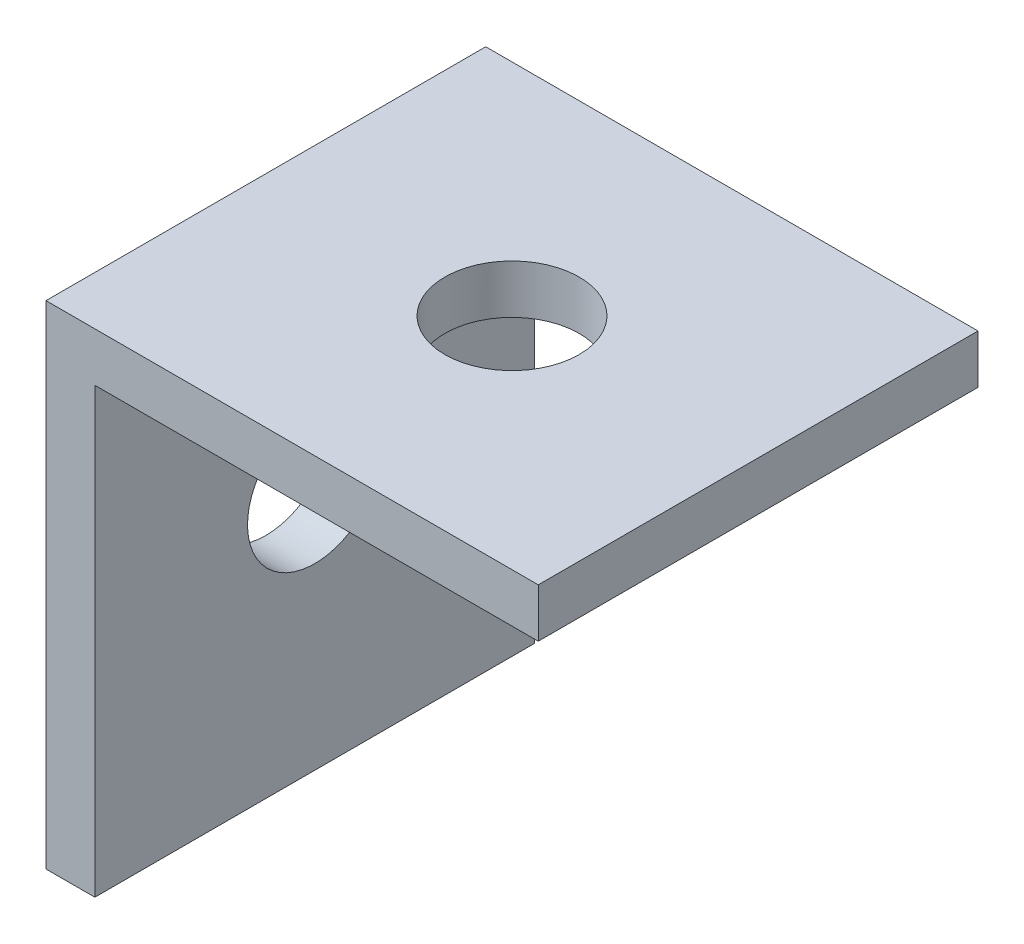
ISO-10303-21;
HEADER;
FILE_DESCRIPTION(('STEP AP214'),'2;1');
FILE_NAME('part.step','',(''),(''),'','','');
FILE_SCHEMA(('AUTOMOTIVE_DESIGN { 1 0 10303 214 1 1 1 1 }'));
ENDSEC;
DATA;
#1=APPLICATION_CONTEXT('core data for automotive mechanical design processes');
#2=APPLICATION_PROTOCOL_DEFINITION('international standard','automotive_design',2000,#1);
#3=PRODUCT_CONTEXT('',#1,'mechanical');
#4=PRODUCT('Part','Part','',(#3));
#5=PRODUCT_RELATED_PRODUCT_CATEGORY('part','',(#4));
#6=PRODUCT_DEFINITION_FORMATION('','',#4);
#7=PRODUCT_DEFINITION_CONTEXT('part definition',#1,'design');
#8=PRODUCT_DEFINITION('design','',#6,#7);
#9=PRODUCT_DEFINITION_SHAPE('','',#8);
#10=(LENGTH_UNIT() NAMED_UNIT(*) SI_UNIT(.MILLI.,.METRE.));
#11=(NAMED_UNIT(*) PLANE_ANGLE_UNIT() SI_UNIT($,.RADIAN.));
#12=(NAMED_UNIT(*) SI_UNIT($,.STERADIAN.) SOLID_ANGLE_UNIT());
#13=UNCERTAINTY_MEASURE_WITH_UNIT(LENGTH_MEASURE(1.E-05),#10,'distance_accuracy_value','');
#14=(GEOMETRIC_REPRESENTATION_CONTEXT(3) GLOBAL_UNCERTAINTY_ASSIGNED_CONTEXT((#13)) GLOBAL_UNIT_ASSIGNED_CONTEXT((#10,
#11,#12)) REPRESENTATION_CONTEXT('',''));
#15=CARTESIAN_POINT('',(0.,0.,0.));
#16=DIRECTION('',(0.,0.,1.));
#17=DIRECTION('',(1.,0.,0.));
#18=AXIS2_PLACEMENT_3D('',#15,#16,#17);
#19=CARTESIAN_POINT('',(0.,0.,-18.));
#20=DIRECTION('',(0.,1.,0.));
#21=DIRECTION('',(0.,0.,1.));
#22=AXIS2_PLACEMENT_3D('',#19,#20,#21);
#23=PLANE('',#22);
#24=CARTESIAN_POINT('',(10.075,0.,-9.));
#25=DIRECTION('',(0.,1.,0.));
#26=DIRECTION('',(0.,0.,1.));
#27=AXIS2_PLACEMENT_3D('',#24,#25,#26);
#28=CIRCLE('',#27,2.75);
#29=CARTESIAN_POINT('',(10.075,0.,-6.25));
#30=VERTEX_POINT('',#29);
#31=EDGE_CURVE('E122',#30,#30,#28,.T.);
#32=ORIENTED_EDGE('',*,*,#31,.F.);
#33=EDGE_LOOP('',(#32));
#34=FACE_BOUND('',#33,.T.);
#35=DIRECTION('',(-1.,0.,0.));
#36=VECTOR('',#35,1.);
#37=CARTESIAN_POINT('',(0.,0.,0.));
#38=LINE('',#37,#36);
#39=CARTESIAN_POINT('',(20.15,0.,0.));
#40=VERTEX_POINT('',#39);
#41=CARTESIAN_POINT('',(0.,0.,0.));
#42=VERTEX_POINT('',#41);
#43=EDGE_CURVE('E118',#40,#42,#38,.T.);
#44=ORIENTED_EDGE('',*,*,#43,.F.);
#45=DIRECTION('',(0.,0.,1.));
#46=VECTOR('',#45,1.);
#47=CARTESIAN_POINT('',(20.15,0.,-18.));
#48=LINE('',#47,#46);
#49=CARTESIAN_POINT('',(20.15,0.,-18.));
#50=VERTEX_POINT('',#49);
#51=EDGE_CURVE('E11',#50,#40,#48,.T.);
#52=ORIENTED_EDGE('',*,*,#51,.F.);
#53=DIRECTION('',(-1.,0.,0.));
#54=VECTOR('',#53,1.);
#55=CARTESIAN_POINT('',(0.,0.,-18.));
#56=LINE('',#55,#54);
#57=CARTESIAN_POINT('',(0.,0.,-18.));
#58=VERTEX_POINT('',#57);
#59=EDGE_CURVE('E133',#50,#58,#56,.T.);
#60=ORIENTED_EDGE('',*,*,#59,.T.);
#61=DIRECTION('',(0.,0.,1.));
#62=VECTOR('',#61,1.);
#63=CARTESIAN_POINT('',(0.,0.,-18.));
#64=LINE('',#63,#62);
#65=EDGE_CURVE('E82',#58,#42,#64,.T.);
#66=ORIENTED_EDGE('',*,*,#65,.T.);
#67=EDGE_LOOP('',(#44,#52,#60,#66));
#68=FACE_BOUND('',#67,.T.);
#69=ADVANCED_FACE('F32',(#34,#68),#23,.T.);
#70=CARTESIAN_POINT('',(20.15,-2.00000000000002,-18.));
#71=DIRECTION('',(1.,0.,0.));
#72=DIRECTION('',(0.,1.,0.));
#73=AXIS2_PLACEMENT_3D('',#70,#71,#72);
#74=PLANE('',#73);
#75=DIRECTION('',(0.,1.,0.));
#76=VECTOR('',#75,1.);
#77=CARTESIAN_POINT('',(20.15,-2.00000000000002,0.));
#78=LINE('',#77,#76);
#79=CARTESIAN_POINT('',(20.15,-2.00000000000002,0.));
#80=VERTEX_POINT('',#79);
#81=EDGE_CURVE('E131',#80,#40,#78,.T.);
#82=ORIENTED_EDGE('',*,*,#81,.F.);
#83=DIRECTION('',(0.,0.,1.));
#84=VECTOR('',#83,1.);
#85=CARTESIAN_POINT('',(20.15,-2.00000000000002,-18.));
#86=LINE('',#85,#84);
#87=CARTESIAN_POINT('',(20.15,-2.00000000000002,-18.));
#88=VERTEX_POINT('',#87);
#89=EDGE_CURVE('E41',#88,#80,#86,.T.);
#90=ORIENTED_EDGE('',*,*,#89,.F.);
#91=DIRECTION('',(0.,1.,0.));
#92=VECTOR('',#91,1.);
#93=CARTESIAN_POINT('',(20.15,-2.00000000000002,-18.));
#94=LINE('',#93,#92);
#95=EDGE_CURVE('E108',#88,#50,#94,.T.);
#96=ORIENTED_EDGE('',*,*,#95,.T.);
#97=ORIENTED_EDGE('',*,*,#51,.T.);
#98=EDGE_LOOP('',(#82,#90,#96,#97));
#99=FACE_BOUND('',#98,.T.);
#100=ADVANCED_FACE('F142',(#99),#74,.T.);
#101=CARTESIAN_POINT('',(2.,-2.00000000000002,-18.));
#102=DIRECTION('',(0.,-1.,0.));
#103=DIRECTION('',(1.,0.,0.));
#104=AXIS2_PLACEMENT_3D('',#101,#102,#103);
#105=PLANE('',#104);
#106=CARTESIAN_POINT('',(10.075,-2.00000000000002,-9.));
#107=DIRECTION('',(0.,-1.,0.));
#108=DIRECTION('',(1.,0.,0.));
#109=AXIS2_PLACEMENT_3D('',#106,#107,#108);
#110=CIRCLE('',#109,2.75);
#111=CARTESIAN_POINT('',(12.825,-2.00000000000002,-9.));
#112=VERTEX_POINT('',#111);
#113=EDGE_CURVE('E169',#112,#112,#110,.T.);
#114=ORIENTED_EDGE('',*,*,#113,.F.);
#115=EDGE_LOOP('',(#114));
#116=FACE_BOUND('',#115,.T.);
#117=DIRECTION('',(1.,0.,0.));
#118=VECTOR('',#117,1.);
#119=CARTESIAN_POINT('',(2.,-2.00000000000002,0.));
#120=LINE('',#119,#118);
#121=CARTESIAN_POINT('',(2.,-2.00000000000002,0.));
#122=VERTEX_POINT('',#121);
#123=EDGE_CURVE('E95',#122,#80,#120,.T.);
#124=ORIENTED_EDGE('',*,*,#123,.F.);
#125=DIRECTION('',(0.,0.,1.));
#126=VECTOR('',#125,1.);
#127=CARTESIAN_POINT('',(2.,-2.00000000000002,-18.));
#128=LINE('',#127,#126);
#129=CARTESIAN_POINT('',(2.,-2.00000000000002,-18.));
#130=VERTEX_POINT('',#129);
#131=EDGE_CURVE('E90',#130,#122,#128,.T.);
#132=ORIENTED_EDGE('',*,*,#131,.F.);
#133=DIRECTION('',(1.,0.,0.));
#134=VECTOR('',#133,1.);
#135=CARTESIAN_POINT('',(2.,-2.00000000000002,-18.));
#136=LINE('',#135,#134);
#137=EDGE_CURVE('E93',#130,#88,#136,.T.);
#138=ORIENTED_EDGE('',*,*,#137,.T.);
#139=ORIENTED_EDGE('',*,*,#89,.T.);
#140=EDGE_LOOP('',(#124,#132,#138,#139));
#141=FACE_BOUND('',#140,.T.);
#142=ADVANCED_FACE('F92',(#116,#141),#105,.T.);
#143=CARTESIAN_POINT('',(2.,-2.00000000000002,-18.));
#144=DIRECTION('',(1.,0.,0.));
#145=DIRECTION('',(0.,1.,0.));
#146=AXIS2_PLACEMENT_3D('',#143,#144,#145);
#147=PLANE('',#146);
#148=CARTESIAN_POINT('',(2.,-10.075,-9.));
#149=DIRECTION('',(1.,0.,0.));
#150=DIRECTION('',(0.,1.,0.));
#151=AXIS2_PLACEMENT_3D('',#148,#149,#150);
#152=CIRCLE('',#151,2.75);
#153=CARTESIAN_POINT('',(2.,-7.325,-9.));
#154=VERTEX_POINT('',#153);
#155=EDGE_CURVE('E170',#154,#154,#152,.T.);
#156=ORIENTED_EDGE('',*,*,#155,.F.);
#157=EDGE_LOOP('',(#156));
#158=FACE_BOUND('',#157,.T.);
#159=DIRECTION('',(0.,1.,0.));
#160=VECTOR('',#159,1.);
#161=CARTESIAN_POINT('',(2.,-2.00000000000002,0.));
#162=LINE('',#161,#160);
#163=CARTESIAN_POINT('',(2.,-20.15,0.));
#164=VERTEX_POINT('',#163);
#165=EDGE_CURVE('E128',#164,#122,#162,.T.);
#166=ORIENTED_EDGE('',*,*,#165,.F.);
#167=DIRECTION('',(0.,0.,1.));
#168=VECTOR('',#167,1.);
#169=CARTESIAN_POINT('',(2.,-20.15,-18.));
#170=LINE('',#169,#168);
#171=CARTESIAN_POINT('',(2.,-20.15,-18.));
#172=VERTEX_POINT('',#171);
#173=EDGE_CURVE('E100',#172,#164,#170,.T.);
#174=ORIENTED_EDGE('',*,*,#173,.F.);
#175=DIRECTION('',(0.,1.,0.));
#176=VECTOR('',#175,1.);
#177=CARTESIAN_POINT('',(2.,-2.00000000000002,-18.));
#178=LINE('',#177,#176);
#179=EDGE_CURVE('E106',#172,#130,#178,.T.);
#180=ORIENTED_EDGE('',*,*,#179,.T.);
#181=ORIENTED_EDGE('',*,*,#131,.T.);
#182=EDGE_LOOP('',(#166,#174,#180,#181));
#183=FACE_BOUND('',#182,.T.);
#184=ADVANCED_FACE('F110',(#158,#183),#147,.T.);
#185=CARTESIAN_POINT('',(2.,-20.15,-18.));
#186=DIRECTION('',(0.,-1.,0.));
#187=DIRECTION('',(0.,0.,-1.));
#188=AXIS2_PLACEMENT_3D('',#185,#186,#187);
#189=PLANE('',#188);
#190=DIRECTION('',(1.,0.,0.));
#191=VECTOR('',#190,1.);
#192=CARTESIAN_POINT('',(2.,-20.15,0.));
#193=LINE('',#192,#191);
#194=CARTESIAN_POINT('',(0.,-20.15,0.));
#195=VERTEX_POINT('',#194);
#196=EDGE_CURVE('E125',#195,#164,#193,.T.);
#197=ORIENTED_EDGE('',*,*,#196,.F.);
#198=DIRECTION('',(0.,0.,1.));
#199=VECTOR('',#198,1.);
#200=CARTESIAN_POINT('',(0.,-20.15,-18.));
#201=LINE('',#200,#199);
#202=CARTESIAN_POINT('',(0.,-20.15,-18.));
#203=VERTEX_POINT('',#202);
#204=EDGE_CURVE('E137',#203,#195,#201,.T.);
#205=ORIENTED_EDGE('',*,*,#204,.F.);
#206=DIRECTION('',(1.,0.,0.));
#207=VECTOR('',#206,1.);
#208=CARTESIAN_POINT('',(2.,-20.15,-18.));
#209=LINE('',#208,#207);
#210=EDGE_CURVE('E111',#203,#172,#209,.T.);
#211=ORIENTED_EDGE('',*,*,#210,.T.);
#212=ORIENTED_EDGE('',*,*,#173,.T.);
#213=EDGE_LOOP('',(#197,#205,#211,#212));
#214=FACE_BOUND('',#213,.T.);
#215=ADVANCED_FACE('F157',(#214),#189,.T.);
#216=CARTESIAN_POINT('',(0.,0.,-18.));
#217=DIRECTION('',(-1.,0.,0.));
#218=DIRECTION('',(0.,-1.,0.));
#219=AXIS2_PLACEMENT_3D('',#216,#217,#218);
#220=PLANE('',#219);
#221=CARTESIAN_POINT('',(0.,-10.075,-9.));
#222=DIRECTION('',(-1.,0.,0.));
#223=DIRECTION('',(0.,-1.,0.));
#224=AXIS2_PLACEMENT_3D('',#221,#222,#223);
#225=CIRCLE('',#224,2.75);
#226=CARTESIAN_POINT('',(0.,-12.825,-9.));
#227=VERTEX_POINT('',#226);
#228=EDGE_CURVE('E35',#227,#227,#225,.T.);
#229=ORIENTED_EDGE('',*,*,#228,.F.);
#230=EDGE_LOOP('',(#229));
#231=FACE_BOUND('',#230,.T.);
#232=DIRECTION('',(0.,-1.,0.));
#233=VECTOR('',#232,1.);
#234=CARTESIAN_POINT('',(0.,0.,0.));
#235=LINE('',#234,#233);
#236=EDGE_CURVE('E121',#42,#195,#235,.T.);
#237=ORIENTED_EDGE('',*,*,#236,.F.);
#238=ORIENTED_EDGE('',*,*,#65,.F.);
#239=DIRECTION('',(0.,-1.,0.));
#240=VECTOR('',#239,1.);
#241=CARTESIAN_POINT('',(0.,0.,-18.));
#242=LINE('',#241,#240);
#243=EDGE_CURVE('E113',#58,#203,#242,.T.);
#244=ORIENTED_EDGE('',*,*,#243,.T.);
#245=ORIENTED_EDGE('',*,*,#204,.T.);
#246=EDGE_LOOP('',(#237,#238,#244,#245));
#247=FACE_BOUND('',#246,.T.);
#248=ADVANCED_FACE('F138',(#231,#247),#220,.T.);
#249=CARTESIAN_POINT('',(0.,0.,-18.));
#250=DIRECTION('',(0.,0.,1.));
#251=DIRECTION('',(1.,0.,0.));
#252=AXIS2_PLACEMENT_3D('',#249,#250,#251);
#253=PLANE('',#252);
#254=ORIENTED_EDGE('',*,*,#59,.F.);
#255=ORIENTED_EDGE('',*,*,#95,.F.);
#256=ORIENTED_EDGE('',*,*,#137,.F.);
#257=ORIENTED_EDGE('',*,*,#179,.F.);
#258=ORIENTED_EDGE('',*,*,#210,.F.);
#259=ORIENTED_EDGE('',*,*,#243,.F.);
#260=EDGE_LOOP('',(#254,#255,#256,#257,#258,#259));
#261=FACE_BOUND('',#260,.T.);
#262=ADVANCED_FACE('F104',(#261),#253,.F.);
#263=CARTESIAN_POINT('',(0.,0.,0.));
#264=DIRECTION('',(0.,0.,1.));
#265=DIRECTION('',(1.,0.,0.));
#266=AXIS2_PLACEMENT_3D('',#263,#264,#265);
#267=PLANE('',#266);
#268=ORIENTED_EDGE('',*,*,#43,.T.);
#269=ORIENTED_EDGE('',*,*,#236,.T.);
#270=ORIENTED_EDGE('',*,*,#196,.T.);
#271=ORIENTED_EDGE('',*,*,#165,.T.);
#272=ORIENTED_EDGE('',*,*,#123,.T.);
#273=ORIENTED_EDGE('',*,*,#81,.T.);
#274=EDGE_LOOP('',(#268,#269,#270,#271,#272,#273));
#275=FACE_BOUND('',#274,.T.);
#276=ADVANCED_FACE('F141',(#275),#267,.T.);
#277=CARTESIAN_POINT('',(10.075,16.,-9.));
#278=DIRECTION('',(0.,-1.,0.));
#279=DIRECTION('',(1.,0.,0.));
#280=AXIS2_PLACEMENT_3D('',#277,#278,#279);
#281=CYLINDRICAL_SURFACE('',#280,2.75);
#282=ORIENTED_EDGE('',*,*,#31,.T.);
#283=EDGE_LOOP('',(#282));
#284=FACE_BOUND('',#283,.T.);
#285=ORIENTED_EDGE('',*,*,#113,.T.);
#286=EDGE_LOOP('',(#285));
#287=FACE_BOUND('',#286,.T.);
#288=ADVANCED_FACE('F182',(#284,#287),#281,.F.);
#289=CARTESIAN_POINT('',(-16.,-10.075,-9.));
#290=DIRECTION('',(1.,0.,0.));
#291=DIRECTION('',(0.,1.,0.));
#292=AXIS2_PLACEMENT_3D('',#289,#290,#291);
#293=CYLINDRICAL_SURFACE('',#292,2.75);
#294=ORIENTED_EDGE('',*,*,#228,.T.);
#295=EDGE_LOOP('',(#294));
#296=FACE_BOUND('',#295,.T.);
#297=ORIENTED_EDGE('',*,*,#155,.T.);
#298=EDGE_LOOP('',(#297));
#299=FACE_BOUND('',#298,.T.);
#300=ADVANCED_FACE('F185',(#296,#299),#293,.F.);
#301=CLOSED_SHELL('',(#69,#100,#142,#184,#215,#248,#262,#276,#288,#300));
#302=MANIFOLD_SOLID_BREP('B2',#301);
#303=ADVANCED_BREP_SHAPE_REPRESENTATION('',(#18,#302),#14);
#304=SHAPE_DEFINITION_REPRESENTATION(#9,#303);
ENDSEC;
END-ISO-10303-21;
